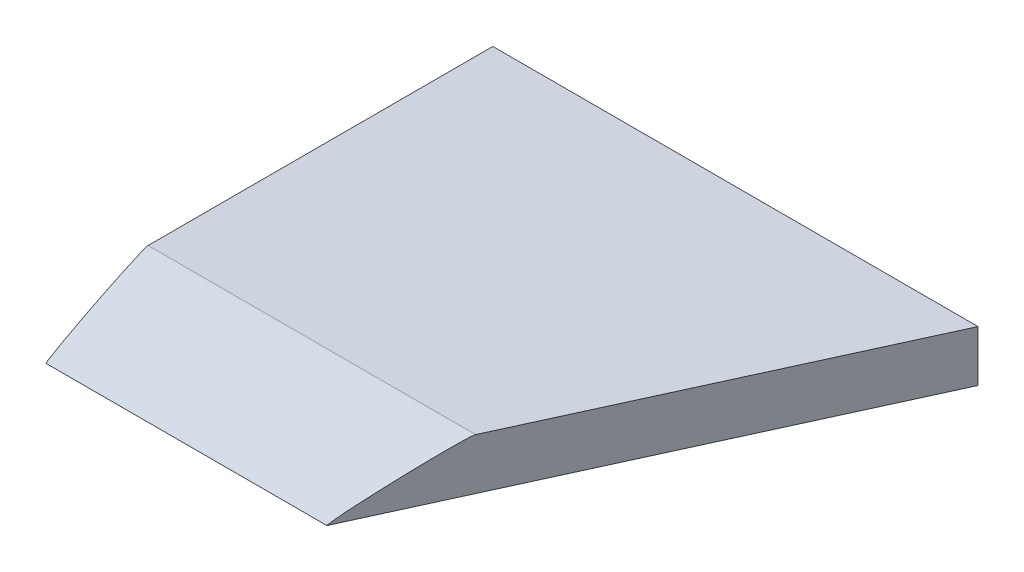
ISO-10303-21;
HEADER;
FILE_DESCRIPTION(('STEP AP214'),'2;1');
FILE_NAME('part.step','',(''),(''),'','','');
FILE_SCHEMA(('AUTOMOTIVE_DESIGN { 1 0 10303 214 1 1 1 1 }'));
ENDSEC;
DATA;
#1=APPLICATION_CONTEXT('core data for automotive mechanical design processes');
#2=APPLICATION_PROTOCOL_DEFINITION('international standard','automotive_design',2000,#1);
#3=PRODUCT_CONTEXT('',#1,'mechanical');
#4=PRODUCT('Part','Part','',(#3));
#5=PRODUCT_RELATED_PRODUCT_CATEGORY('part','',(#4));
#6=PRODUCT_DEFINITION_FORMATION('','',#4);
#7=PRODUCT_DEFINITION_CONTEXT('part definition',#1,'design');
#8=PRODUCT_DEFINITION('design','',#6,#7);
#9=PRODUCT_DEFINITION_SHAPE('','',#8);
#10=(LENGTH_UNIT() NAMED_UNIT(*) SI_UNIT(.MILLI.,.METRE.));
#11=(NAMED_UNIT(*) PLANE_ANGLE_UNIT() SI_UNIT($,.RADIAN.));
#12=(NAMED_UNIT(*) SI_UNIT($,.STERADIAN.) SOLID_ANGLE_UNIT());
#13=UNCERTAINTY_MEASURE_WITH_UNIT(LENGTH_MEASURE(1.E-05),#10,'distance_accuracy_value','');
#14=(GEOMETRIC_REPRESENTATION_CONTEXT(3) GLOBAL_UNCERTAINTY_ASSIGNED_CONTEXT((#13)) GLOBAL_UNIT_ASSIGNED_CONTEXT((#10,
#11,#12)) REPRESENTATION_CONTEXT('',''));
#15=CARTESIAN_POINT('',(0.,0.,0.));
#16=DIRECTION('',(0.,0.,1.));
#17=DIRECTION('',(1.,0.,0.));
#18=AXIS2_PLACEMENT_3D('',#15,#16,#17);
#19=CARTESIAN_POINT('',(0.,4.,0.));
#20=DIRECTION('',(1.,0.,0.));
#21=DIRECTION('',(0.,0.,-1.));
#22=AXIS2_PLACEMENT_3D('',#19,#20,#21);
#23=PLANE('',#22);
#24=DIRECTION('',(0.,0.,1.));
#25=VECTOR('',#24,1.);
#26=CARTESIAN_POINT('',(0.,0.,0.));
#27=LINE('',#26,#25);
#28=CARTESIAN_POINT('',(0.,0.,0.));
#29=VERTEX_POINT('',#28);
#30=CARTESIAN_POINT('',(0.,0.,35.));
#31=VERTEX_POINT('',#30);
#32=EDGE_CURVE('E170',#29,#31,#27,.T.);
#33=ORIENTED_EDGE('',*,*,#32,.T.);
#34=CARTESIAN_POINT('',(0.,4.,27.));
#35=CARTESIAN_POINT('',(0.,4.,32.));
#36=CARTESIAN_POINT('',(0.,0.,35.));
#37=(BOUNDED_CURVE() B_SPLINE_CURVE(2,(#34,#35,#36),.UNSPECIFIED.,.F.,
.F.) B_SPLINE_CURVE_WITH_KNOTS((3,3),(0.,1.),
.UNSPECIFIED.) CURVE() GEOMETRIC_REPRESENTATION_ITEM() RATIONAL_B_SPLINE_CURVE((1.,
0.0894427190999916,1.)) REPRESENTATION_ITEM(''));
#38=CARTESIAN_POINT('',(0.,4.,27.));
#39=VERTEX_POINT('',#38);
#40=EDGE_CURVE('E12',#31,#39,#37,.F.);
#41=ORIENTED_EDGE('',*,*,#40,.T.);
#42=DIRECTION('',(0.,0.,1.));
#43=VECTOR('',#42,1.);
#44=CARTESIAN_POINT('',(0.,4.,0.));
#45=LINE('',#44,#43);
#46=CARTESIAN_POINT('',(0.,4.,0.));
#47=VERTEX_POINT('',#46);
#48=EDGE_CURVE('E104',#47,#39,#45,.T.);
#49=ORIENTED_EDGE('',*,*,#48,.F.);
#50=DIRECTION('',(0.,-1.,0.));
#51=VECTOR('',#50,1.);
#52=CARTESIAN_POINT('',(0.,4.,0.));
#53=LINE('',#52,#51);
#54=EDGE_CURVE('E114',#47,#29,#53,.T.);
#55=ORIENTED_EDGE('',*,*,#54,.T.);
#56=EDGE_LOOP('',(#33,#41,#49,#55));
#57=FACE_BOUND('',#56,.T.);
#58=ADVANCED_FACE('F44',(#57),#23,.F.);
#59=CARTESIAN_POINT('',(22.,4.,35.));
#60=DIRECTION('',(-0.9094744755858,0.,-0.415759760267794));
#61=DIRECTION('',(-0.415759760267794,0.,0.9094744755858));
#62=AXIS2_PLACEMENT_3D('',#59,#60,#61);
#63=PLANE('',#62);
#64=DIRECTION('',(0.415759760267794,0.,-0.9094744755858));
#65=VECTOR('',#64,1.);
#66=CARTESIAN_POINT('',(22.,4.,35.));
#67=LINE('',#66,#65);
#68=CARTESIAN_POINT('',(25.6571428571429,4.,27.));
#69=VERTEX_POINT('',#68);
#70=CARTESIAN_POINT('',(38.,4.,0.));
#71=VERTEX_POINT('',#70);
#72=EDGE_CURVE('E94',#69,#71,#67,.T.);
#73=ORIENTED_EDGE('',*,*,#72,.F.);
#74=CARTESIAN_POINT('',(22.,0.,35.));
#75=CARTESIAN_POINT('',(22.0005252527769,0.00152679714052975,34.998852041291));
#76=CARTESIAN_POINT('',(22.0010735226767,0.00301741834538121,34.9976686707278));
#77=CARTESIAN_POINT('',(22.0022716083086,0.00611084750642765,34.9951047335075));
#78=CARTESIAN_POINT('',(22.002925792776,0.00770631573301808,34.9937173144813));
#79=CARTESIAN_POINT('',(22.0043352301338,0.0110113086703608,34.9907428725109));
#80=CARTESIAN_POINT('',(22.0050937653129,0.0127145265166462,34.9891504818969));
#81=CARTESIAN_POINT('',(22.0067132674804,0.016234938191222,34.9857611327828));
#82=CARTESIAN_POINT('',(22.0075768960949,0.0180465149162663,34.9839596326217));
#83=CARTESIAN_POINT('',(22.010444396996,0.0239060466875865,34.9779876616639));
#84=CARTESIAN_POINT('',(22.0124930369675,0.0278489831066966,34.9737360151667));
#85=CARTESIAN_POINT('',(22.0169975225062,0.0362169617723181,34.9643868674221));
#86=CARTESIAN_POINT('',(22.0194638588122,0.0406114159141617,34.9592674662129));
#87=CARTESIAN_POINT('',(22.0248088423533,0.0498843183274311,34.9481542835089));
#88=CARTESIAN_POINT('',(22.0276944471646,0.0547380341579693,34.942143313446));
#89=CARTESIAN_POINT('',(22.0338808849197,0.0649320320050734,34.9292232332296));
#90=CARTESIAN_POINT('',(22.037186241966,0.0702519530267247,34.9223003181009));
#91=CARTESIAN_POINT('',(22.0483245026442,0.0878958483724801,34.8988990658338));
#92=CARTESIAN_POINT('',(22.0562076473024,0.0999162593915042,34.8822167489576));
#93=CARTESIAN_POINT('',(22.0848387256609,0.14279002633239,34.8212435362901));
#94=CARTESIAN_POINT('',(22.105657714417,0.172477288179386,34.77617757199));
#95=CARTESIAN_POINT('',(22.1539737496695,0.240129493258278,34.6706127874722));
#96=CARTESIAN_POINT('',(22.1814524826842,0.277665570663708,34.6098375133705));
#97=CARTESIAN_POINT('',(22.2834572221184,0.414695110324452,34.3837318701157));
#98=CARTESIAN_POINT('',(22.3584204195618,0.510853336377274,34.2165837043541));
#99=CARTESIAN_POINT('',(22.4774163821384,0.658238945744007,33.9552996891089));
#100=CARTESIAN_POINT('',(22.5205504875796,0.710625132740599,33.8613881039184));
#101=CARTESIAN_POINT('',(22.6137487809867,0.822980926319275,33.6580196127329));
#102=CARTESIAN_POINT('',(22.6638132729659,0.882817084006599,33.5484886185772));
#103=CARTESIAN_POINT('',(22.7708370853839,1.00993304830311,33.3138642826081));
#104=CARTESIAN_POINT('',(22.8277944218633,1.07710050351108,33.1887093342749));
#105=CARTESIAN_POINT('',(22.9194634160511,1.18346553738366,32.988965781549));
#106=CARTESIAN_POINT('',(22.9538535948761,1.22298644166563,32.9144020006776));
#107=CARTESIAN_POINT('',(23.0291527351919,1.30893822370764,32.7515537894294));
#108=CARTESIAN_POINT('',(23.0701024005567,1.3553094379621,32.6632567556791));
#109=CARTESIAN_POINT('',(23.15845700406,1.4552986034823,32.4719964392308));
#110=CARTESIAN_POINT('',(23.2058256705239,1.50886517732321,32.3689895242466));
#111=CARTESIAN_POINT('',(23.3070890143198,1.6233148541906,32.1478301607069));
#112=CARTESIAN_POINT('',(23.360942501825,1.68414226408716,32.0296300516793));
#113=CARTESIAN_POINT('',(23.475078507566,1.81284767771105,31.7782170143688));
#114=CARTESIAN_POINT('',(23.5353305234022,1.88066507766401,31.6449592208149));
#115=CARTESIAN_POINT('',(23.6624862123228,2.02253067186593,31.3646259949414));
#116=CARTESIAN_POINT('',(23.7294383675476,2.09650462570718,31.2175349811363));
#117=CARTESIAN_POINT('',(23.8649320101346,2.24534061316948,30.9197647125952));
#118=CARTESIAN_POINT('',(23.933475829001,2.32018598288987,30.7690781954625));
#119=CARTESIAN_POINT('',(24.0634045528453,2.46165234219773,30.4824170477451));
#120=CARTESIAN_POINT('',(24.1248154893764,2.52834276100435,30.3464885021803));
#121=CARTESIAN_POINT('',(24.240877839746,2.6530605865029,30.0907179878537));
#122=CARTESIAN_POINT('',(24.2954633073846,2.71117385615866,29.970888027317));
#123=CARTESIAN_POINT('',(24.3977968630517,2.81889727504894,29.7474527342156));
#124=CARTESIAN_POINT('',(24.4454675968415,2.86859115044924,29.6438523744461));
#125=CARTESIAN_POINT('',(24.5340357053658,2.95994513280502,29.4523341653679));
#126=CARTESIAN_POINT('',(24.5748640577251,3.00168082105321,29.3644203980388));
#127=CARTESIAN_POINT('',(24.6494986339014,3.07782543363356,29.2031809817216));
#128=CARTESIAN_POINT('',(24.6833299533307,3.11228502348955,29.1298909030351));
#129=CARTESIAN_POINT('',(24.775940138885,3.20665570433927,28.9281986613968));
#130=CARTESIAN_POINT('',(24.8344571120471,3.2663304441005,28.7995657892989));
#131=CARTESIAN_POINT('',(24.9446696438935,3.37725637381746,28.55792947712));
#132=CARTESIAN_POINT('',(24.9963132662233,3.42863615362386,28.4449616889638));
#133=CARTESIAN_POINT('',(25.0927121666572,3.52310264009368,28.2345921874589));
#134=CARTESIAN_POINT('',(25.1374156433106,3.5663401482556,28.1372337836022));
#135=CARTESIAN_POINT('',(25.2613698167877,3.6856069829354,27.8651632143974));
#136=CARTESIAN_POINT('',(25.3401534960725,3.76069526941368,27.6898060479017));
#137=CARTESIAN_POINT('',(25.4494310474224,3.85773346865606,27.4479436940478));
#138=CARTESIAN_POINT('',(25.479051905746,3.88333657598762,27.3825189624819));
#139=CARTESIAN_POINT('',(25.5318748295267,3.92629408286105,27.2670970909534));
#140=CARTESIAN_POINT('',(25.554891326586,3.94414304852132,27.2172066233268));
#141=CARTESIAN_POINT('',(25.587340642129,3.96660361127884,27.147791905265));
#142=CARTESIAN_POINT('',(25.5963870269809,3.97258453545533,27.1285358961047));
#143=CARTESIAN_POINT('',(25.6128581812362,3.9826166787075,27.0936628891766));
#144=CARTESIAN_POINT('',(25.6202517151822,3.98681602096039,27.0780755252884));
#145=CARTESIAN_POINT('',(25.6307710039398,3.99200046813436,27.0559416458881));
#146=CARTESIAN_POINT('',(25.6338467420533,3.99342239990451,27.0494750659003));
#147=CARTESIAN_POINT('',(25.6395868947303,3.99581682711461,27.0373963871488));
#148=CARTESIAN_POINT('',(25.642249072564,3.99682431915115,27.0317904230564));
#149=CARTESIAN_POINT('',(25.6460874083451,3.99805020669314,27.0236782539479));
#150=CARTESIAN_POINT('',(25.6472624868989,3.99839491117345,27.0211907954106));
#151=CARTESIAN_POINT('',(25.6495089015566,3.99897807650695,27.0164219316673));
#152=CARTESIAN_POINT('',(25.6505803750794,3.9992231687305,27.0141414138967));
#153=CARTESIAN_POINT('',(25.6526196226429,3.9996089666134,27.0097834568208));
#154=CARTESIAN_POINT('',(25.653587754824,3.99975727191088,27.0077068987449));
#155=CARTESIAN_POINT('',(25.6554193564958,3.99994716311057,27.0037541477248));
#156=CARTESIAN_POINT('',(25.6562835903969,3.99999795563552,27.0018787334537));
#157=CARTESIAN_POINT('',(25.6571428571429,4.,27.));
#158=B_SPLINE_CURVE_WITH_KNOTS('',3,(#74,#75,#76,#77,#78,#79,#80,#81,#82,#83,#84,#85,#86,#87,
#88,#89,#90,#91,#92,#93,#94,#95,#96,#97,#98,#99,#100,#101,#102,#103,#104,#105,#106,#107,#108,
#109,#110,#111,#112,#113,#114,#115,#116,#117,#118,#119,#120,#121,#122,#123,#124,#125,#126,#127,
#128,#129,#130,#131,#132,#133,#134,#135,#136,#137,#138,#139,#140,#141,#142,#143,#144,#145,#146,
#147,#148,#149,#150,#151,#152,#153,#154,#155,#156,#157),.UNSPECIFIED.,.F.,.F.,(4,2,2,2,2,2,2,2,
2,2,2,2,2,2,2,2,2,2,2,2,2,2,2,2,2,2,2,2,2,2,2,2,2,2,2,2,2,2,2,2,2,4),(0.,0.00594072688678588,
0.012578034484632,0.0199326150928899,0.0280220863642109,0.0464643812527388,0.068011458535849,
0.0927503358557824,0.1207552611871,0.186806896426788,0.360284524653356,0.589879895966339,
1.210428068701,1.55802052890687,1.96144320753393,2.42054066909992,2.69392391700867,
3.01736064518872,3.39354051350019,3.82382140991972,4.30743544835511,4.84064451623238,
5.38567344084078,5.87583410024842,6.30762267528326,6.68081629014032,6.9974207283262,
7.26072792176404,7.72092628510585,8.1241778754508,8.47076437739876,9.08980185367996,
9.31852599893875,9.4917778032247,9.55806972498224,9.61131537188268,9.63321412703121,
9.65206972690449,9.66038650775367,9.66798022405901,9.67486623961072,9.68106206797874),.UNSPECIFIED.);
#159=CARTESIAN_POINT('',(22.,0.,35.));
#160=VERTEX_POINT('',#159);
#161=EDGE_CURVE('E60',#69,#160,#158,.F.);
#162=ORIENTED_EDGE('',*,*,#161,.T.);
#163=DIRECTION('',(0.415759760267794,0.,-0.9094744755858));
#164=VECTOR('',#163,1.);
#165=CARTESIAN_POINT('',(22.,0.,35.));
#166=LINE('',#165,#164);
#167=CARTESIAN_POINT('',(38.,0.,0.));
#168=VERTEX_POINT('',#167);
#169=EDGE_CURVE('E110',#160,#168,#166,.T.);
#170=ORIENTED_EDGE('',*,*,#169,.T.);
#171=DIRECTION('',(0.,-1.,0.));
#172=VECTOR('',#171,1.);
#173=CARTESIAN_POINT('',(38.,4.,0.));
#174=LINE('',#173,#172);
#175=EDGE_CURVE('E107',#71,#168,#174,.T.);
#176=ORIENTED_EDGE('',*,*,#175,.F.);
#177=EDGE_LOOP('',(#73,#162,#170,#176));
#178=FACE_BOUND('',#177,.T.);
#179=ADVANCED_FACE('F108',(#178),#63,.F.);
#180=CARTESIAN_POINT('',(0.,4.,0.));
#181=DIRECTION('',(0.,0.,1.));
#182=DIRECTION('',(1.,0.,0.));
#183=AXIS2_PLACEMENT_3D('',#180,#181,#182);
#184=PLANE('',#183);
#185=DIRECTION('',(-1.,0.,0.));
#186=VECTOR('',#185,1.);
#187=CARTESIAN_POINT('',(0.,0.,0.));
#188=LINE('',#187,#186);
#189=EDGE_CURVE('E126',#168,#29,#188,.T.);
#190=ORIENTED_EDGE('',*,*,#189,.T.);
#191=ORIENTED_EDGE('',*,*,#54,.F.);
#192=DIRECTION('',(-1.,0.,0.));
#193=VECTOR('',#192,1.);
#194=CARTESIAN_POINT('',(0.,4.,0.));
#195=LINE('',#194,#193);
#196=EDGE_CURVE('E98',#71,#47,#195,.T.);
#197=ORIENTED_EDGE('',*,*,#196,.F.);
#198=ORIENTED_EDGE('',*,*,#175,.T.);
#199=EDGE_LOOP('',(#190,#191,#197,#198));
#200=FACE_BOUND('',#199,.T.);
#201=ADVANCED_FACE('F116',(#200),#184,.F.);
#202=CARTESIAN_POINT('',(0.,4.,0.));
#203=DIRECTION('',(0.,1.,0.));
#204=DIRECTION('',(0.,0.,1.));
#205=AXIS2_PLACEMENT_3D('',#202,#203,#204);
#206=PLANE('',#205);
#207=ORIENTED_EDGE('',*,*,#48,.T.);
#208=CARTESIAN_POINT('',(26.9399999999978,4.,27.));
#209=CARTESIAN_POINT('',(17.5323809523795,4.,27.));
#210=CARTESIAN_POINT('',(8.12476190476126,4.,27.));
#211=CARTESIAN_POINT('',(-1.28285714285704,4.,27.));
#212=(BOUNDED_CURVE() B_SPLINE_CURVE(3,(#208,#209,#210,#211),.UNSPECIFIED.,.F.,
.F.) B_SPLINE_CURVE_WITH_KNOTS((4,4),(-0.0269399999999978,0.00128285714285704),
.UNSPECIFIED.) CURVE() GEOMETRIC_REPRESENTATION_ITEM() RATIONAL_B_SPLINE_CURVE((1.,1.,1.,1.)) REPRESENTATION_ITEM(''));
#213=EDGE_CURVE('E100',#39,#69,#212,.F.);
#214=ORIENTED_EDGE('',*,*,#213,.T.);
#215=ORIENTED_EDGE('',*,*,#72,.T.);
#216=ORIENTED_EDGE('',*,*,#196,.T.);
#217=EDGE_LOOP('',(#207,#214,#215,#216));
#218=FACE_BOUND('',#217,.T.);
#219=ADVANCED_FACE('F96',(#218),#206,.T.);
#220=CARTESIAN_POINT('',(0.,0.,0.));
#221=DIRECTION('',(0.,1.,0.));
#222=DIRECTION('',(0.,0.,1.));
#223=AXIS2_PLACEMENT_3D('',#220,#221,#222);
#224=PLANE('',#223);
#225=ORIENTED_EDGE('',*,*,#32,.F.);
#226=ORIENTED_EDGE('',*,*,#189,.F.);
#227=ORIENTED_EDGE('',*,*,#169,.F.);
#228=CARTESIAN_POINT('',(-1.28285714285704,0.,35.));
#229=CARTESIAN_POINT('',(8.12476190476126,0.,35.));
#230=CARTESIAN_POINT('',(17.5323809523795,0.,35.));
#231=CARTESIAN_POINT('',(26.9399999999978,0.,35.));
#232=(BOUNDED_CURVE() B_SPLINE_CURVE(3,(#228,#229,#230,#231),.UNSPECIFIED.,.F.,
.F.) B_SPLINE_CURVE_WITH_KNOTS((4,4),(-0.0269399999999978,0.00128285714285704),
.UNSPECIFIED.) CURVE() GEOMETRIC_REPRESENTATION_ITEM() RATIONAL_B_SPLINE_CURVE((1.,1.,1.,1.)) REPRESENTATION_ITEM(''));
#233=EDGE_CURVE('E164',#31,#160,#232,.T.);
#234=ORIENTED_EDGE('',*,*,#233,.F.);
#235=EDGE_LOOP('',(#225,#226,#227,#234));
#236=FACE_BOUND('',#235,.T.);
#237=ADVANCED_FACE('F144',(#236),#224,.F.);
#238=CARTESIAN_POINT('',(26.9399999999978,0.,35.));
#239=CARTESIAN_POINT('',(17.5323809523795,0.,35.));
#240=CARTESIAN_POINT('',(8.12476190476126,0.,35.));
#241=CARTESIAN_POINT('',(-1.28285714285704,0.,35.));
#242=CARTESIAN_POINT('',(26.9399999999978,4.,32.));
#243=CARTESIAN_POINT('',(17.5323809523795,4.,32.));
#244=CARTESIAN_POINT('',(8.12476190476126,4.,32.));
#245=CARTESIAN_POINT('',(-1.28285714285704,4.,32.));
#246=CARTESIAN_POINT('',(26.9399999999978,4.,27.));
#247=CARTESIAN_POINT('',(17.5323809523795,4.,27.));
#248=CARTESIAN_POINT('',(8.12476190476126,4.,27.));
#249=CARTESIAN_POINT('',(-1.28285714285704,4.,27.));
#250=(BOUNDED_SURFACE() B_SPLINE_SURFACE(2,3,((#238,#239,#240,#241),(#242,#243,#244,#245),(#246,
#247,#248,#249)),.UNSPECIFIED.,.F.,.F.,.F.) B_SPLINE_SURFACE_WITH_KNOTS((3,3),(4,4),(0.,1.),
(-0.0269399999999978,0.00128285714285704),
.UNSPECIFIED.) GEOMETRIC_REPRESENTATION_ITEM() RATIONAL_B_SPLINE_SURFACE(((1.,1.,1.,1.),
(0.0894427190999916,0.0894427190999916,0.0894427190999916,0.0894427190999916),(1.,1.,1.,1.))) REPRESENTATION_ITEM('') SURFACE());
#251=ORIENTED_EDGE('',*,*,#40,.F.);
#252=ORIENTED_EDGE('',*,*,#233,.T.);
#253=ORIENTED_EDGE('',*,*,#161,.F.);
#254=ORIENTED_EDGE('',*,*,#213,.F.);
#255=EDGE_LOOP('',(#251,#252,#253,#254));
#256=FACE_BOUND('',#255,.T.);
#257=ADVANCED_FACE('F47',(#256),#250,.T.);
#258=CLOSED_SHELL('',(#58,#179,#201,#219,#237,#257));
#259=MANIFOLD_SOLID_BREP('B2',#258);
#260=ADVANCED_BREP_SHAPE_REPRESENTATION('',(#18,#259),#14);
#261=SHAPE_DEFINITION_REPRESENTATION(#9,#260);
ENDSEC;
END-ISO-10303-21;
